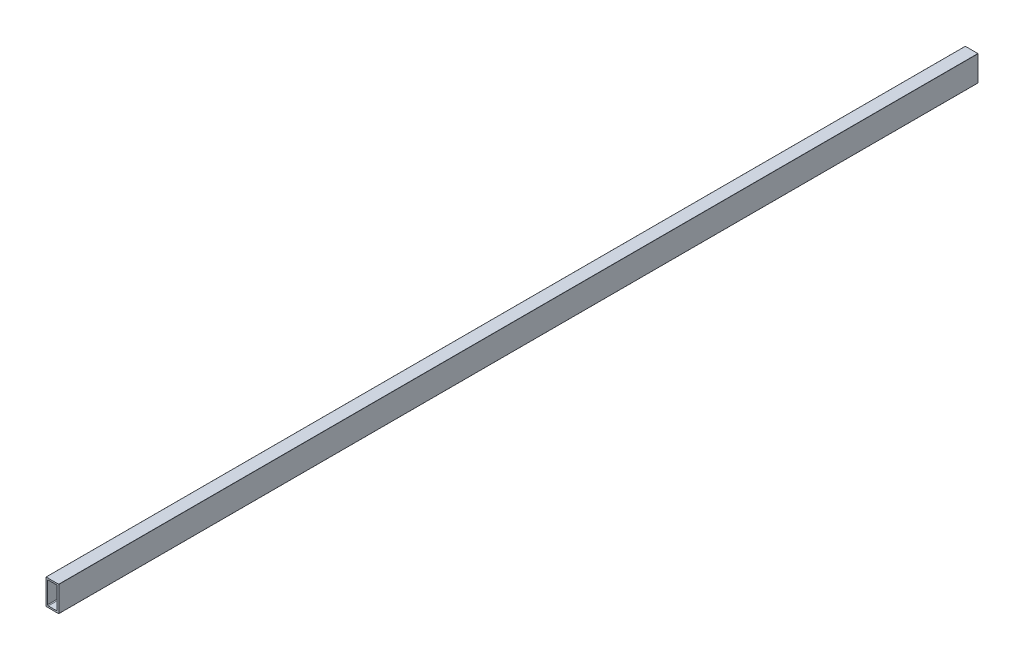
ISO-10303-21;
HEADER;
FILE_DESCRIPTION(('STEP AP214'),'2;1');
FILE_NAME('part.step','',(''),(''),'','','');
FILE_SCHEMA(('AUTOMOTIVE_DESIGN { 1 0 10303 214 1 1 1 1 }'));
ENDSEC;
DATA;
#1=APPLICATION_CONTEXT('core data for automotive mechanical design processes');
#2=APPLICATION_PROTOCOL_DEFINITION('international standard','automotive_design',2000,#1);
#3=PRODUCT_CONTEXT('',#1,'mechanical');
#4=PRODUCT('Part','Part','',(#3));
#5=PRODUCT_RELATED_PRODUCT_CATEGORY('part','',(#4));
#6=PRODUCT_DEFINITION_FORMATION('','',#4);
#7=PRODUCT_DEFINITION_CONTEXT('part definition',#1,'design');
#8=PRODUCT_DEFINITION('design','',#6,#7);
#9=PRODUCT_DEFINITION_SHAPE('','',#8);
#10=(LENGTH_UNIT() NAMED_UNIT(*) SI_UNIT(.MILLI.,.METRE.));
#11=(NAMED_UNIT(*) PLANE_ANGLE_UNIT() SI_UNIT($,.RADIAN.));
#12=(NAMED_UNIT(*) SI_UNIT($,.STERADIAN.) SOLID_ANGLE_UNIT());
#13=UNCERTAINTY_MEASURE_WITH_UNIT(LENGTH_MEASURE(1.E-05),#10,'distance_accuracy_value','');
#14=(GEOMETRIC_REPRESENTATION_CONTEXT(3) GLOBAL_UNCERTAINTY_ASSIGNED_CONTEXT((#13)) GLOBAL_UNIT_ASSIGNED_CONTEXT((#10,
#11,#12)) REPRESENTATION_CONTEXT('',''));
#15=CARTESIAN_POINT('',(0.,0.,0.));
#16=DIRECTION('',(0.,0.,1.));
#17=DIRECTION('',(1.,0.,0.));
#18=AXIS2_PLACEMENT_3D('',#15,#16,#17);
#19=CARTESIAN_POINT('',(3.175,4.7625,1828.8));
#20=DIRECTION('',(1.,0.,0.));
#21=DIRECTION('',(0.,1.,0.));
#22=AXIS2_PLACEMENT_3D('',#19,#20,#21);
#23=PLANE('',#22);
#24=DIRECTION('',(0.,-1.,0.));
#25=VECTOR('',#24,1.);
#26=CARTESIAN_POINT('',(3.175,4.7625,0.));
#27=LINE('',#26,#25);
#28=CARTESIAN_POINT('',(3.175,46.0375,0.));
#29=VERTEX_POINT('',#28);
#30=CARTESIAN_POINT('',(3.175,4.7625,0.));
#31=VERTEX_POINT('',#30);
#32=EDGE_CURVE('E243',#29,#31,#27,.T.);
#33=ORIENTED_EDGE('',*,*,#32,.F.);
#34=DIRECTION('',(0.,0.,-1.));
#35=VECTOR('',#34,1.);
#36=CARTESIAN_POINT('',(3.175,46.0375,1828.8));
#37=LINE('',#36,#35);
#38=CARTESIAN_POINT('',(3.175,46.0375,1828.8));
#39=VERTEX_POINT('',#38);
#40=EDGE_CURVE('E9',#39,#29,#37,.T.);
#41=ORIENTED_EDGE('',*,*,#40,.F.);
#42=DIRECTION('',(0.,-1.,0.));
#43=VECTOR('',#42,1.);
#44=CARTESIAN_POINT('',(3.175,4.7625,1828.8));
#45=LINE('',#44,#43);
#46=CARTESIAN_POINT('',(3.175,4.7625,1828.8));
#47=VERTEX_POINT('',#46);
#48=EDGE_CURVE('E238',#39,#47,#45,.T.);
#49=ORIENTED_EDGE('',*,*,#48,.T.);
#50=DIRECTION('',(0.,0.,-1.));
#51=VECTOR('',#50,1.);
#52=CARTESIAN_POINT('',(3.175,4.7625,1828.8));
#53=LINE('',#52,#51);
#54=EDGE_CURVE('E119',#47,#31,#53,.T.);
#55=ORIENTED_EDGE('',*,*,#54,.T.);
#56=EDGE_LOOP('',(#33,#41,#49,#55));
#57=FACE_BOUND('',#56,.T.);
#58=ADVANCED_FACE('F15',(#57),#23,.T.);
#59=CARTESIAN_POINT('',(4.7625,46.0375,1828.8));
#60=DIRECTION('',(0.,0.,-1.));
#61=DIRECTION('',(-1.,0.,0.));
#62=AXIS2_PLACEMENT_3D('',#59,#60,#61);
#63=CYLINDRICAL_SURFACE('',#62,1.5875);
#64=CARTESIAN_POINT('',(4.7625,46.0375,0.));
#65=DIRECTION('',(0.,0.,1.));
#66=DIRECTION('',(-1.,0.,0.));
#67=AXIS2_PLACEMENT_3D('',#64,#65,#66);
#68=CIRCLE('',#67,1.5875);
#69=CARTESIAN_POINT('',(4.7625,47.625,0.));
#70=VERTEX_POINT('',#69);
#71=EDGE_CURVE('E212',#70,#29,#68,.T.);
#72=ORIENTED_EDGE('',*,*,#71,.F.);
#73=DIRECTION('',(0.,0.,-1.));
#74=VECTOR('',#73,1.);
#75=CARTESIAN_POINT('',(4.7625,47.625,1828.8));
#76=LINE('',#75,#74);
#77=CARTESIAN_POINT('',(4.7625,47.625,1828.8));
#78=VERTEX_POINT('',#77);
#79=EDGE_CURVE('E26',#78,#70,#76,.T.);
#80=ORIENTED_EDGE('',*,*,#79,.F.);
#81=CARTESIAN_POINT('',(4.7625,46.0375,1828.8));
#82=DIRECTION('',(0.,0.,1.));
#83=DIRECTION('',(-1.,0.,0.));
#84=AXIS2_PLACEMENT_3D('',#81,#82,#83);
#85=CIRCLE('',#84,1.5875);
#86=EDGE_CURVE('E259',#78,#39,#85,.T.);
#87=ORIENTED_EDGE('',*,*,#86,.T.);
#88=ORIENTED_EDGE('',*,*,#40,.T.);
#89=EDGE_LOOP('',(#72,#80,#87,#88));
#90=FACE_BOUND('',#89,.T.);
#91=ADVANCED_FACE('F377',(#90),#63,.F.);
#92=CARTESIAN_POINT('',(4.7625,47.625,1828.8));
#93=DIRECTION('',(0.,-1.,0.));
#94=DIRECTION('',(0.,0.,-1.));
#95=AXIS2_PLACEMENT_3D('',#92,#93,#94);
#96=PLANE('',#95);
#97=DIRECTION('',(-1.,0.,0.));
#98=VECTOR('',#97,1.);
#99=CARTESIAN_POINT('',(4.7625,47.625,0.));
#100=LINE('',#99,#98);
#101=CARTESIAN_POINT('',(20.6375,47.625,0.));
#102=VERTEX_POINT('',#101);
#103=EDGE_CURVE('E299',#102,#70,#100,.T.);
#104=ORIENTED_EDGE('',*,*,#103,.F.);
#105=DIRECTION('',(0.,0.,-1.));
#106=VECTOR('',#105,1.);
#107=CARTESIAN_POINT('',(20.6375,47.625,1828.8));
#108=LINE('',#107,#106);
#109=CARTESIAN_POINT('',(20.6375,47.625,1828.8));
#110=VERTEX_POINT('',#109);
#111=EDGE_CURVE('E214',#110,#102,#108,.T.);
#112=ORIENTED_EDGE('',*,*,#111,.F.);
#113=DIRECTION('',(-1.,0.,0.));
#114=VECTOR('',#113,1.);
#115=CARTESIAN_POINT('',(4.7625,47.625,1828.8));
#116=LINE('',#115,#114);
#117=EDGE_CURVE('E234',#110,#78,#116,.T.);
#118=ORIENTED_EDGE('',*,*,#117,.T.);
#119=ORIENTED_EDGE('',*,*,#79,.T.);
#120=EDGE_LOOP('',(#104,#112,#118,#119));
#121=FACE_BOUND('',#120,.T.);
#122=ADVANCED_FACE('F370',(#121),#96,.T.);
#123=CARTESIAN_POINT('',(20.6375,46.0375,1828.8));
#124=DIRECTION('',(0.,0.,-1.));
#125=DIRECTION('',(-1.,0.,0.));
#126=AXIS2_PLACEMENT_3D('',#123,#124,#125);
#127=CYLINDRICAL_SURFACE('',#126,1.5875);
#128=CARTESIAN_POINT('',(20.6375,46.0375,0.));
#129=DIRECTION('',(0.,0.,1.));
#130=DIRECTION('',(-1.,0.,0.));
#131=AXIS2_PLACEMENT_3D('',#128,#129,#130);
#132=CIRCLE('',#131,1.5875);
#133=CARTESIAN_POINT('',(22.225,46.0375,0.));
#134=VERTEX_POINT('',#133);
#135=EDGE_CURVE('E263',#134,#102,#132,.T.);
#136=ORIENTED_EDGE('',*,*,#135,.F.);
#137=DIRECTION('',(0.,0.,-1.));
#138=VECTOR('',#137,1.);
#139=CARTESIAN_POINT('',(22.225,46.0375,1828.8));
#140=LINE('',#139,#138);
#141=CARTESIAN_POINT('',(22.225,46.0375,1828.8));
#142=VERTEX_POINT('',#141);
#143=EDGE_CURVE('E217',#142,#134,#140,.T.);
#144=ORIENTED_EDGE('',*,*,#143,.F.);
#145=CARTESIAN_POINT('',(20.6375,46.0375,1828.8));
#146=DIRECTION('',(0.,0.,1.));
#147=DIRECTION('',(-1.,0.,0.));
#148=AXIS2_PLACEMENT_3D('',#145,#146,#147);
#149=CIRCLE('',#148,1.5875);
#150=EDGE_CURVE('E229',#142,#110,#149,.T.);
#151=ORIENTED_EDGE('',*,*,#150,.T.);
#152=ORIENTED_EDGE('',*,*,#111,.T.);
#153=EDGE_LOOP('',(#136,#144,#151,#152));
#154=FACE_BOUND('',#153,.T.);
#155=ADVANCED_FACE('F604',(#154),#127,.F.);
#156=CARTESIAN_POINT('',(22.225,4.7625,1828.8));
#157=DIRECTION('',(-1.,0.,0.));
#158=DIRECTION('',(0.,0.,1.));
#159=AXIS2_PLACEMENT_3D('',#156,#157,#158);
#160=PLANE('',#159);
#161=DIRECTION('',(0.,1.,0.));
#162=VECTOR('',#161,1.);
#163=CARTESIAN_POINT('',(22.225,4.7625,0.));
#164=LINE('',#163,#162);
#165=CARTESIAN_POINT('',(22.225,4.7625,0.));
#166=VERTEX_POINT('',#165);
#167=EDGE_CURVE('E260',#166,#134,#164,.T.);
#168=ORIENTED_EDGE('',*,*,#167,.F.);
#169=DIRECTION('',(0.,0.,-1.));
#170=VECTOR('',#169,1.);
#171=CARTESIAN_POINT('',(22.225,4.7625,1828.8));
#172=LINE('',#171,#170);
#173=CARTESIAN_POINT('',(22.225,4.7625,1828.8));
#174=VERTEX_POINT('',#173);
#175=EDGE_CURVE('E311',#174,#166,#172,.T.);
#176=ORIENTED_EDGE('',*,*,#175,.F.);
#177=DIRECTION('',(0.,1.,0.));
#178=VECTOR('',#177,1.);
#179=CARTESIAN_POINT('',(22.225,4.7625,1828.8));
#180=LINE('',#179,#178);
#181=EDGE_CURVE('E233',#174,#142,#180,.T.);
#182=ORIENTED_EDGE('',*,*,#181,.T.);
#183=ORIENTED_EDGE('',*,*,#143,.T.);
#184=EDGE_LOOP('',(#168,#176,#182,#183));
#185=FACE_BOUND('',#184,.T.);
#186=ADVANCED_FACE('F554',(#185),#160,.T.);
#187=CARTESIAN_POINT('',(20.6375,4.7625,1828.8));
#188=DIRECTION('',(0.,0.,-1.));
#189=DIRECTION('',(-1.,0.,0.));
#190=AXIS2_PLACEMENT_3D('',#187,#188,#189);
#191=CYLINDRICAL_SURFACE('',#190,1.5875);
#192=CARTESIAN_POINT('',(20.6375,4.7625,0.));
#193=DIRECTION('',(0.,0.,1.));
#194=DIRECTION('',(-1.,0.,0.));
#195=AXIS2_PLACEMENT_3D('',#192,#193,#194);
#196=CIRCLE('',#195,1.5875);
#197=CARTESIAN_POINT('',(20.6375,3.175,0.));
#198=VERTEX_POINT('',#197);
#199=EDGE_CURVE('E227',#198,#166,#196,.T.);
#200=ORIENTED_EDGE('',*,*,#199,.F.);
#201=DIRECTION('',(0.,0.,-1.));
#202=VECTOR('',#201,1.);
#203=CARTESIAN_POINT('',(20.6375,3.175,1828.8));
#204=LINE('',#203,#202);
#205=CARTESIAN_POINT('',(20.6375,3.175,1828.8));
#206=VERTEX_POINT('',#205);
#207=EDGE_CURVE('E249',#206,#198,#204,.T.);
#208=ORIENTED_EDGE('',*,*,#207,.F.);
#209=CARTESIAN_POINT('',(20.6375,4.7625,1828.8));
#210=DIRECTION('',(0.,0.,1.));
#211=DIRECTION('',(-1.,0.,0.));
#212=AXIS2_PLACEMENT_3D('',#209,#210,#211);
#213=CIRCLE('',#212,1.5875);
#214=EDGE_CURVE('E222',#206,#174,#213,.T.);
#215=ORIENTED_EDGE('',*,*,#214,.T.);
#216=ORIENTED_EDGE('',*,*,#175,.T.);
#217=EDGE_LOOP('',(#200,#208,#215,#216));
#218=FACE_BOUND('',#217,.T.);
#219=ADVANCED_FACE('F548',(#218),#191,.F.);
#220=CARTESIAN_POINT('',(4.7625,3.175,1828.8));
#221=DIRECTION('',(0.,1.,0.));
#222=DIRECTION('',(1.,0.,0.));
#223=AXIS2_PLACEMENT_3D('',#220,#221,#222);
#224=PLANE('',#223);
#225=DIRECTION('',(1.,0.,0.));
#226=VECTOR('',#225,1.);
#227=CARTESIAN_POINT('',(4.7625,3.175,0.));
#228=LINE('',#227,#226);
#229=CARTESIAN_POINT('',(4.7625,3.175,0.));
#230=VERTEX_POINT('',#229);
#231=EDGE_CURVE('E223',#230,#198,#228,.T.);
#232=ORIENTED_EDGE('',*,*,#231,.F.);
#233=DIRECTION('',(0.,0.,-1.));
#234=VECTOR('',#233,1.);
#235=CARTESIAN_POINT('',(4.7625,3.175,1828.8));
#236=LINE('',#235,#234);
#237=CARTESIAN_POINT('',(4.7625,3.175,1828.8));
#238=VERTEX_POINT('',#237);
#239=EDGE_CURVE('E133',#238,#230,#236,.T.);
#240=ORIENTED_EDGE('',*,*,#239,.F.);
#241=DIRECTION('',(1.,0.,0.));
#242=VECTOR('',#241,1.);
#243=CARTESIAN_POINT('',(4.7625,3.175,1828.8));
#244=LINE('',#243,#242);
#245=EDGE_CURVE('E218',#238,#206,#244,.T.);
#246=ORIENTED_EDGE('',*,*,#245,.T.);
#247=ORIENTED_EDGE('',*,*,#207,.T.);
#248=EDGE_LOOP('',(#232,#240,#246,#247));
#249=FACE_BOUND('',#248,.T.);
#250=ADVANCED_FACE('F553',(#249),#224,.T.);
#251=CARTESIAN_POINT('',(4.7625,4.7625,1828.8));
#252=DIRECTION('',(0.,0.,-1.));
#253=DIRECTION('',(-1.,0.,0.));
#254=AXIS2_PLACEMENT_3D('',#251,#252,#253);
#255=CYLINDRICAL_SURFACE('',#254,1.5875);
#256=CARTESIAN_POINT('',(4.7625,4.7625,0.));
#257=DIRECTION('',(0.,0.,1.));
#258=DIRECTION('',(1.,0.,0.));
#259=AXIS2_PLACEMENT_3D('',#256,#257,#258);
#260=CIRCLE('',#259,1.5875);
#261=EDGE_CURVE('E228',#31,#230,#260,.T.);
#262=ORIENTED_EDGE('',*,*,#261,.F.);
#263=ORIENTED_EDGE('',*,*,#54,.F.);
#264=CARTESIAN_POINT('',(4.7625,4.7625,1828.8));
#265=DIRECTION('',(0.,0.,1.));
#266=DIRECTION('',(1.,0.,0.));
#267=AXIS2_PLACEMENT_3D('',#264,#265,#266);
#268=CIRCLE('',#267,1.5875);
#269=EDGE_CURVE('E235',#47,#238,#268,.T.);
#270=ORIENTED_EDGE('',*,*,#269,.T.);
#271=ORIENTED_EDGE('',*,*,#239,.T.);
#272=EDGE_LOOP('',(#262,#263,#270,#271));
#273=FACE_BOUND('',#272,.T.);
#274=ADVANCED_FACE('F594',(#273),#255,.F.);
#275=CARTESIAN_POINT('',(0.,0.254,1828.8));
#276=DIRECTION('',(1.,0.,0.));
#277=DIRECTION('',(0.,1.,0.));
#278=AXIS2_PLACEMENT_3D('',#275,#276,#277);
#279=PLANE('',#278);
#280=DIRECTION('',(0.,-1.,0.));
#281=VECTOR('',#280,1.);
#282=CARTESIAN_POINT('',(0.,0.254,0.));
#283=LINE('',#282,#281);
#284=CARTESIAN_POINT('',(0.,50.546,0.));
#285=VERTEX_POINT('',#284);
#286=CARTESIAN_POINT('',(0.,0.254,0.));
#287=VERTEX_POINT('',#286);
#288=EDGE_CURVE('E208',#285,#287,#283,.T.);
#289=ORIENTED_EDGE('',*,*,#288,.T.);
#290=DIRECTION('',(0.,0.,-1.));
#291=VECTOR('',#290,1.);
#292=CARTESIAN_POINT('',(0.,0.254,1828.8));
#293=LINE('',#292,#291);
#294=CARTESIAN_POINT('',(0.,0.254,1828.8));
#295=VERTEX_POINT('',#294);
#296=EDGE_CURVE('E314',#295,#287,#293,.T.);
#297=ORIENTED_EDGE('',*,*,#296,.F.);
#298=DIRECTION('',(0.,-1.,0.));
#299=VECTOR('',#298,1.);
#300=CARTESIAN_POINT('',(0.,0.254,1828.8));
#301=LINE('',#300,#299);
#302=CARTESIAN_POINT('',(0.,50.546,1828.8));
#303=VERTEX_POINT('',#302);
#304=EDGE_CURVE('E239',#303,#295,#301,.T.);
#305=ORIENTED_EDGE('',*,*,#304,.F.);
#306=DIRECTION('',(0.,0.,-1.));
#307=VECTOR('',#306,1.);
#308=CARTESIAN_POINT('',(0.,50.546,1828.8));
#309=LINE('',#308,#307);
#310=EDGE_CURVE('E331',#303,#285,#309,.T.);
#311=ORIENTED_EDGE('',*,*,#310,.T.);
#312=EDGE_LOOP('',(#289,#297,#305,#311));
#313=FACE_BOUND('',#312,.T.);
#314=ADVANCED_FACE('F17',(#313),#279,.F.);
#315=CARTESIAN_POINT('',(0.254,50.546,1828.8));
#316=DIRECTION('',(0.,0.,-1.));
#317=DIRECTION('',(-1.,0.,0.));
#318=AXIS2_PLACEMENT_3D('',#315,#316,#317);
#319=CYLINDRICAL_SURFACE('',#318,0.253999999999995);
#320=CARTESIAN_POINT('',(0.254,50.546,0.));
#321=DIRECTION('',(0.,0.,1.));
#322=DIRECTION('',(-1.,0.,0.));
#323=AXIS2_PLACEMENT_3D('',#320,#321,#322);
#324=CIRCLE('',#323,0.253999999999995);
#325=CARTESIAN_POINT('',(0.254,50.8,0.));
#326=VERTEX_POINT('',#325);
#327=EDGE_CURVE('E201',#326,#285,#324,.T.);
#328=ORIENTED_EDGE('',*,*,#327,.T.);
#329=ORIENTED_EDGE('',*,*,#310,.F.);
#330=CARTESIAN_POINT('',(0.254,50.546,1828.8));
#331=DIRECTION('',(0.,0.,1.));
#332=DIRECTION('',(-1.,0.,0.));
#333=AXIS2_PLACEMENT_3D('',#330,#331,#332);
#334=CIRCLE('',#333,0.253999999999995);
#335=CARTESIAN_POINT('',(0.254,50.8,1828.8));
#336=VERTEX_POINT('',#335);
#337=EDGE_CURVE('E265',#336,#303,#334,.T.);
#338=ORIENTED_EDGE('',*,*,#337,.F.);
#339=DIRECTION('',(0.,0.,-1.));
#340=VECTOR('',#339,1.);
#341=CARTESIAN_POINT('',(0.254,50.8,1828.8));
#342=LINE('',#341,#340);
#343=EDGE_CURVE('E167',#336,#326,#342,.T.);
#344=ORIENTED_EDGE('',*,*,#343,.T.);
#345=EDGE_LOOP('',(#328,#329,#338,#344));
#346=FACE_BOUND('',#345,.T.);
#347=ADVANCED_FACE('F660',(#346),#319,.T.);
#348=CARTESIAN_POINT('',(0.254,50.8,1828.8));
#349=DIRECTION('',(0.,-1.,0.));
#350=DIRECTION('',(0.,0.,-1.));
#351=AXIS2_PLACEMENT_3D('',#348,#349,#350);
#352=PLANE('',#351);
#353=DIRECTION('',(-1.,0.,0.));
#354=VECTOR('',#353,1.);
#355=CARTESIAN_POINT('',(0.254,50.8,0.));
#356=LINE('',#355,#354);
#357=CARTESIAN_POINT('',(25.146,50.8,0.));
#358=VERTEX_POINT('',#357);
#359=EDGE_CURVE('E178',#358,#326,#356,.T.);
#360=ORIENTED_EDGE('',*,*,#359,.T.);
#361=ORIENTED_EDGE('',*,*,#343,.F.);
#362=DIRECTION('',(-1.,0.,0.));
#363=VECTOR('',#362,1.);
#364=CARTESIAN_POINT('',(0.254,50.8,1828.8));
#365=LINE('',#364,#363);
#366=CARTESIAN_POINT('',(25.146,50.8,1828.8));
#367=VERTEX_POINT('',#366);
#368=EDGE_CURVE('E181',#367,#336,#365,.T.);
#369=ORIENTED_EDGE('',*,*,#368,.F.);
#370=DIRECTION('',(0.,0.,-1.));
#371=VECTOR('',#370,1.);
#372=CARTESIAN_POINT('',(25.146,50.8,1828.8));
#373=LINE('',#372,#371);
#374=EDGE_CURVE('E174',#367,#358,#373,.T.);
#375=ORIENTED_EDGE('',*,*,#374,.T.);
#376=EDGE_LOOP('',(#360,#361,#369,#375));
#377=FACE_BOUND('',#376,.T.);
#378=ADVANCED_FACE('F176',(#377),#352,.F.);
#379=CARTESIAN_POINT('',(25.146,50.546,1828.8));
#380=DIRECTION('',(0.,0.,-1.));
#381=DIRECTION('',(-1.,0.,0.));
#382=AXIS2_PLACEMENT_3D('',#379,#380,#381);
#383=CYLINDRICAL_SURFACE('',#382,0.253999999999994);
#384=CARTESIAN_POINT('',(25.146,50.546,0.));
#385=DIRECTION('',(0.,0.,1.));
#386=DIRECTION('',(-1.,0.,0.));
#387=AXIS2_PLACEMENT_3D('',#384,#385,#386);
#388=CIRCLE('',#387,0.253999999999994);
#389=CARTESIAN_POINT('',(25.4,50.546,0.));
#390=VERTEX_POINT('',#389);
#391=EDGE_CURVE('E189',#390,#358,#388,.T.);
#392=ORIENTED_EDGE('',*,*,#391,.T.);
#393=ORIENTED_EDGE('',*,*,#374,.F.);
#394=CARTESIAN_POINT('',(25.146,50.546,1828.8));
#395=DIRECTION('',(0.,0.,1.));
#396=DIRECTION('',(-1.,0.,0.));
#397=AXIS2_PLACEMENT_3D('',#394,#395,#396);
#398=CIRCLE('',#397,0.253999999999994);
#399=CARTESIAN_POINT('',(25.4,50.546,1828.8));
#400=VERTEX_POINT('',#399);
#401=EDGE_CURVE('E266',#400,#367,#398,.T.);
#402=ORIENTED_EDGE('',*,*,#401,.F.);
#403=DIRECTION('',(0.,0.,-1.));
#404=VECTOR('',#403,1.);
#405=CARTESIAN_POINT('',(25.4,50.546,1828.8));
#406=LINE('',#405,#404);
#407=EDGE_CURVE('E186',#400,#390,#406,.T.);
#408=ORIENTED_EDGE('',*,*,#407,.T.);
#409=EDGE_LOOP('',(#392,#393,#402,#408));
#410=FACE_BOUND('',#409,.T.);
#411=ADVANCED_FACE('F190',(#410),#383,.T.);
#412=CARTESIAN_POINT('',(25.4,0.254,1828.8));
#413=DIRECTION('',(-1.,0.,0.));
#414=DIRECTION('',(0.,0.,1.));
#415=AXIS2_PLACEMENT_3D('',#412,#413,#414);
#416=PLANE('',#415);
#417=DIRECTION('',(0.,1.,0.));
#418=VECTOR('',#417,1.);
#419=CARTESIAN_POINT('',(25.4,0.254,0.));
#420=LINE('',#419,#418);
#421=CARTESIAN_POINT('',(25.4,0.254,0.));
#422=VERTEX_POINT('',#421);
#423=EDGE_CURVE('E196',#422,#390,#420,.T.);
#424=ORIENTED_EDGE('',*,*,#423,.T.);
#425=ORIENTED_EDGE('',*,*,#407,.F.);
#426=DIRECTION('',(0.,1.,0.));
#427=VECTOR('',#426,1.);
#428=CARTESIAN_POINT('',(25.4,0.254,1828.8));
#429=LINE('',#428,#427);
#430=CARTESIAN_POINT('',(25.4,0.254,1828.8));
#431=VERTEX_POINT('',#430);
#432=EDGE_CURVE('E274',#431,#400,#429,.T.);
#433=ORIENTED_EDGE('',*,*,#432,.F.);
#434=DIRECTION('',(0.,0.,-1.));
#435=VECTOR('',#434,1.);
#436=CARTESIAN_POINT('',(25.4,0.254,1828.8));
#437=LINE('',#436,#435);
#438=EDGE_CURVE('E329',#431,#422,#437,.T.);
#439=ORIENTED_EDGE('',*,*,#438,.T.);
#440=EDGE_LOOP('',(#424,#425,#433,#439));
#441=FACE_BOUND('',#440,.T.);
#442=ADVANCED_FACE('F565',(#441),#416,.F.);
#443=CARTESIAN_POINT('',(25.146,0.254,1828.8));
#444=DIRECTION('',(0.,0.,-1.));
#445=DIRECTION('',(-1.,0.,0.));
#446=AXIS2_PLACEMENT_3D('',#443,#444,#445);
#447=CYLINDRICAL_SURFACE('',#446,0.254);
#448=CARTESIAN_POINT('',(25.146,0.254,0.));
#449=DIRECTION('',(0.,0.,1.));
#450=DIRECTION('',(1.,0.,0.));
#451=AXIS2_PLACEMENT_3D('',#448,#449,#450);
#452=CIRCLE('',#451,0.254);
#453=CARTESIAN_POINT('',(25.146,0.,0.));
#454=VERTEX_POINT('',#453);
#455=EDGE_CURVE('E283',#454,#422,#452,.T.);
#456=ORIENTED_EDGE('',*,*,#455,.T.);
#457=ORIENTED_EDGE('',*,*,#438,.F.);
#458=CARTESIAN_POINT('',(25.146,0.254,1828.8));
#459=DIRECTION('',(0.,0.,1.));
#460=DIRECTION('',(1.,0.,0.));
#461=AXIS2_PLACEMENT_3D('',#458,#459,#460);
#462=CIRCLE('',#461,0.254);
#463=CARTESIAN_POINT('',(25.146,0.,1828.8));
#464=VERTEX_POINT('',#463);
#465=EDGE_CURVE('E280',#464,#431,#462,.T.);
#466=ORIENTED_EDGE('',*,*,#465,.F.);
#467=DIRECTION('',(0.,0.,-1.));
#468=VECTOR('',#467,1.);
#469=CARTESIAN_POINT('',(25.146,0.,1828.8));
#470=LINE('',#469,#468);
#471=EDGE_CURVE('E19',#464,#454,#470,.T.);
#472=ORIENTED_EDGE('',*,*,#471,.T.);
#473=EDGE_LOOP('',(#456,#457,#466,#472));
#474=FACE_BOUND('',#473,.T.);
#475=ADVANCED_FACE('F586',(#474),#447,.T.);
#476=CARTESIAN_POINT('',(0.254,0.,1828.8));
#477=DIRECTION('',(0.,1.,0.));
#478=DIRECTION('',(1.,0.,0.));
#479=AXIS2_PLACEMENT_3D('',#476,#477,#478);
#480=PLANE('',#479);
#481=DIRECTION('',(1.,0.,0.));
#482=VECTOR('',#481,1.);
#483=CARTESIAN_POINT('',(0.254,0.,0.));
#484=LINE('',#483,#482);
#485=CARTESIAN_POINT('',(0.254,0.,0.));
#486=VERTEX_POINT('',#485);
#487=EDGE_CURVE('E256',#486,#454,#484,.T.);
#488=ORIENTED_EDGE('',*,*,#487,.T.);
#489=ORIENTED_EDGE('',*,*,#471,.F.);
#490=DIRECTION('',(1.,0.,0.));
#491=VECTOR('',#490,1.);
#492=CARTESIAN_POINT('',(0.254,0.,1828.8));
#493=LINE('',#492,#491);
#494=CARTESIAN_POINT('',(0.254,0.,1828.8));
#495=VERTEX_POINT('',#494);
#496=EDGE_CURVE('E305',#495,#464,#493,.T.);
#497=ORIENTED_EDGE('',*,*,#496,.F.);
#498=DIRECTION('',(0.,0.,-1.));
#499=VECTOR('',#498,1.);
#500=CARTESIAN_POINT('',(0.254,0.,1828.8));
#501=LINE('',#500,#499);
#502=EDGE_CURVE('E317',#495,#486,#501,.T.);
#503=ORIENTED_EDGE('',*,*,#502,.T.);
#504=EDGE_LOOP('',(#488,#489,#497,#503));
#505=FACE_BOUND('',#504,.T.);
#506=ADVANCED_FACE('F581',(#505),#480,.F.);
#507=CARTESIAN_POINT('',(0.254,0.254,1828.8));
#508=DIRECTION('',(0.,0.,-1.));
#509=DIRECTION('',(-1.,0.,0.));
#510=AXIS2_PLACEMENT_3D('',#507,#508,#509);
#511=CYLINDRICAL_SURFACE('',#510,0.254);
#512=CARTESIAN_POINT('',(0.254,0.254,0.));
#513=DIRECTION('',(0.,0.,1.));
#514=DIRECTION('',(-1.,0.,0.));
#515=AXIS2_PLACEMENT_3D('',#512,#513,#514);
#516=CIRCLE('',#515,0.254);
#517=EDGE_CURVE('E221',#287,#486,#516,.T.);
#518=ORIENTED_EDGE('',*,*,#517,.T.);
#519=ORIENTED_EDGE('',*,*,#502,.F.);
#520=CARTESIAN_POINT('',(0.254,0.254,1828.8));
#521=DIRECTION('',(0.,0.,1.));
#522=DIRECTION('',(-1.,0.,0.));
#523=AXIS2_PLACEMENT_3D('',#520,#521,#522);
#524=CIRCLE('',#523,0.254);
#525=EDGE_CURVE('E324',#295,#495,#524,.T.);
#526=ORIENTED_EDGE('',*,*,#525,.F.);
#527=ORIENTED_EDGE('',*,*,#296,.T.);
#528=EDGE_LOOP('',(#518,#519,#526,#527));
#529=FACE_BOUND('',#528,.T.);
#530=ADVANCED_FACE('F585',(#529),#511,.T.);
#531=CARTESIAN_POINT('',(0.254,0.254,0.));
#532=DIRECTION('',(0.,0.,-1.));
#533=DIRECTION('',(0.,-1.,0.));
#534=AXIS2_PLACEMENT_3D('',#531,#532,#533);
#535=PLANE('',#534);
#536=ORIENTED_EDGE('',*,*,#32,.T.);
#537=ORIENTED_EDGE('',*,*,#261,.T.);
#538=ORIENTED_EDGE('',*,*,#231,.T.);
#539=ORIENTED_EDGE('',*,*,#199,.T.);
#540=ORIENTED_EDGE('',*,*,#167,.T.);
#541=ORIENTED_EDGE('',*,*,#135,.T.);
#542=ORIENTED_EDGE('',*,*,#103,.T.);
#543=ORIENTED_EDGE('',*,*,#71,.T.);
#544=EDGE_LOOP('',(#536,#537,#538,#539,#540,#541,#542,#543));
#545=FACE_BOUND('',#544,.T.);
#546=ORIENTED_EDGE('',*,*,#517,.F.);
#547=ORIENTED_EDGE('',*,*,#288,.F.);
#548=ORIENTED_EDGE('',*,*,#327,.F.);
#549=ORIENTED_EDGE('',*,*,#359,.F.);
#550=ORIENTED_EDGE('',*,*,#391,.F.);
#551=ORIENTED_EDGE('',*,*,#423,.F.);
#552=ORIENTED_EDGE('',*,*,#455,.F.);
#553=ORIENTED_EDGE('',*,*,#487,.F.);
#554=EDGE_LOOP('',(#546,#547,#548,#549,#550,#551,#552,#553));
#555=FACE_BOUND('',#554,.T.);
#556=ADVANCED_FACE('F199',(#545,#555),#535,.T.);
#557=CARTESIAN_POINT('',(0.254,0.254,1828.8));
#558=DIRECTION('',(0.,0.,-1.));
#559=DIRECTION('',(0.,-1.,0.));
#560=AXIS2_PLACEMENT_3D('',#557,#558,#559);
#561=PLANE('',#560);
#562=ORIENTED_EDGE('',*,*,#269,.F.);
#563=ORIENTED_EDGE('',*,*,#48,.F.);
#564=ORIENTED_EDGE('',*,*,#86,.F.);
#565=ORIENTED_EDGE('',*,*,#117,.F.);
#566=ORIENTED_EDGE('',*,*,#150,.F.);
#567=ORIENTED_EDGE('',*,*,#181,.F.);
#568=ORIENTED_EDGE('',*,*,#214,.F.);
#569=ORIENTED_EDGE('',*,*,#245,.F.);
#570=EDGE_LOOP('',(#562,#563,#564,#565,#566,#567,#568,#569));
#571=FACE_BOUND('',#570,.T.);
#572=ORIENTED_EDGE('',*,*,#525,.T.);
#573=ORIENTED_EDGE('',*,*,#496,.T.);
#574=ORIENTED_EDGE('',*,*,#465,.T.);
#575=ORIENTED_EDGE('',*,*,#432,.T.);
#576=ORIENTED_EDGE('',*,*,#401,.T.);
#577=ORIENTED_EDGE('',*,*,#368,.T.);
#578=ORIENTED_EDGE('',*,*,#337,.T.);
#579=ORIENTED_EDGE('',*,*,#304,.T.);
#580=EDGE_LOOP('',(#572,#573,#574,#575,#576,#577,#578,#579));
#581=FACE_BOUND('',#580,.T.);
#582=ADVANCED_FACE('F375',(#571,#581),#561,.F.);
#583=CLOSED_SHELL('',(#58,#91,#122,#155,#186,#219,#250,#274,#314,#347,#378,#411,#442,#475,#506,
#530,#556,#582));
#584=MANIFOLD_SOLID_BREP('B1',#583);
#585=ADVANCED_BREP_SHAPE_REPRESENTATION('',(#18,#584),#14);
#586=SHAPE_DEFINITION_REPRESENTATION(#9,#585);
ENDSEC;
END-ISO-10303-21;
